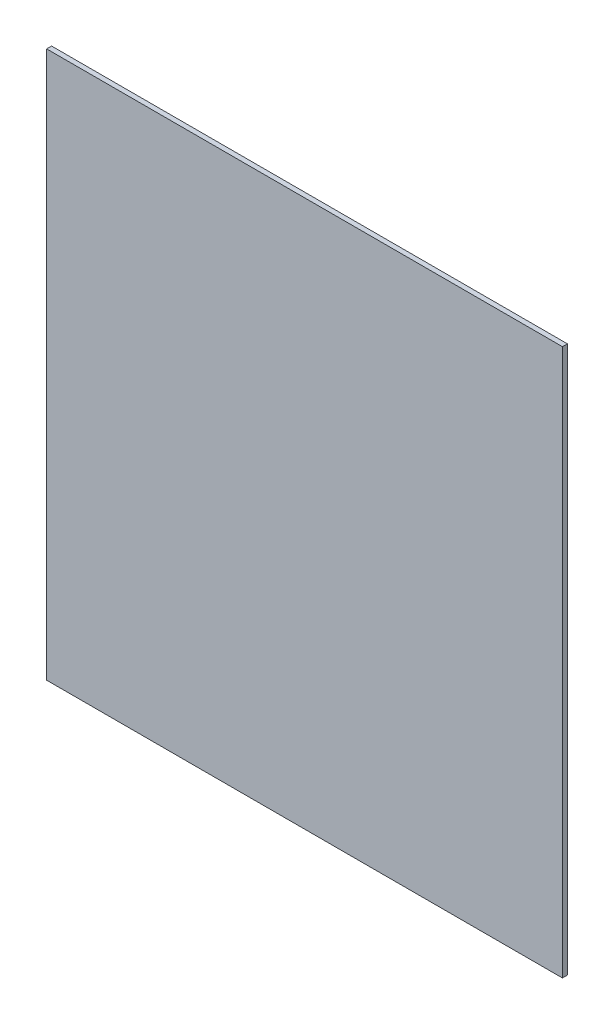
ISO-10303-21;
HEADER;
FILE_DESCRIPTION(('STEP AP214'),'2;1');
FILE_NAME('part.step','',(''),(''),'','','');
FILE_SCHEMA(('AUTOMOTIVE_DESIGN { 1 0 10303 214 1 1 1 1 }'));
ENDSEC;
DATA;
#1=APPLICATION_CONTEXT('core data for automotive mechanical design processes');
#2=APPLICATION_PROTOCOL_DEFINITION('international standard','automotive_design',2000,#1);
#3=PRODUCT_CONTEXT('',#1,'mechanical');
#4=PRODUCT('Part','Part','',(#3));
#5=PRODUCT_RELATED_PRODUCT_CATEGORY('part','',(#4));
#6=PRODUCT_DEFINITION_FORMATION('','',#4);
#7=PRODUCT_DEFINITION_CONTEXT('part definition',#1,'design');
#8=PRODUCT_DEFINITION('design','',#6,#7);
#9=PRODUCT_DEFINITION_SHAPE('','',#8);
#10=(LENGTH_UNIT() NAMED_UNIT(*) SI_UNIT(.MILLI.,.METRE.));
#11=(NAMED_UNIT(*) PLANE_ANGLE_UNIT() SI_UNIT($,.RADIAN.));
#12=(NAMED_UNIT(*) SI_UNIT($,.STERADIAN.) SOLID_ANGLE_UNIT());
#13=UNCERTAINTY_MEASURE_WITH_UNIT(LENGTH_MEASURE(1.E-05),#10,'distance_accuracy_value','');
#14=(GEOMETRIC_REPRESENTATION_CONTEXT(3) GLOBAL_UNCERTAINTY_ASSIGNED_CONTEXT((#13)) GLOBAL_UNIT_ASSIGNED_CONTEXT((#10,
#11,#12)) REPRESENTATION_CONTEXT('',''));
#15=CARTESIAN_POINT('',(0.,0.,0.));
#16=DIRECTION('',(0.,0.,1.));
#17=DIRECTION('',(1.,0.,0.));
#18=AXIS2_PLACEMENT_3D('',#15,#16,#17);
#19=CARTESIAN_POINT('',(-67.04,-91.3291046998612,0.126999999999988));
#20=DIRECTION('',(-1.,0.,0.));
#21=DIRECTION('',(0.,0.,1.));
#22=AXIS2_PLACEMENT_3D('',#19,#20,#21);
#23=PLANE('',#22);
#24=DIRECTION('',(0.,1.,0.));
#25=VECTOR('',#24,1.);
#26=CARTESIAN_POINT('',(-67.04,-91.3291046998612,0.));
#27=LINE('',#26,#25);
#28=CARTESIAN_POINT('',(-67.04,-91.3291046998612,0.));
#29=VERTEX_POINT('',#28);
#30=CARTESIAN_POINT('',(-67.04,-77.2953546998612,0.));
#31=VERTEX_POINT('',#30);
#32=EDGE_CURVE('E95',#29,#31,#27,.T.);
#33=ORIENTED_EDGE('',*,*,#32,.T.);
#34=DIRECTION('',(0.,0.,-1.));
#35=VECTOR('',#34,1.);
#36=CARTESIAN_POINT('',(-67.04,-77.2953546998612,0.126999999999988));
#37=LINE('',#36,#35);
#38=CARTESIAN_POINT('',(-67.04,-77.2953546998612,0.126999999999988));
#39=VERTEX_POINT('',#38);
#40=EDGE_CURVE('E11',#39,#31,#37,.T.);
#41=ORIENTED_EDGE('',*,*,#40,.F.);
#42=DIRECTION('',(0.,1.,0.));
#43=VECTOR('',#42,1.);
#44=CARTESIAN_POINT('',(-67.04,-91.3291046998612,0.126999999999988));
#45=LINE('',#44,#43);
#46=CARTESIAN_POINT('',(-67.04,-91.3291046998612,0.126999999999988));
#47=VERTEX_POINT('',#46);
#48=EDGE_CURVE('E83',#47,#39,#45,.T.);
#49=ORIENTED_EDGE('',*,*,#48,.F.);
#50=DIRECTION('',(0.,0.,-1.));
#51=VECTOR('',#50,1.);
#52=CARTESIAN_POINT('',(-67.04,-91.3291046998612,0.126999999999988));
#53=LINE('',#52,#51);
#54=EDGE_CURVE('E91',#47,#29,#53,.T.);
#55=ORIENTED_EDGE('',*,*,#54,.T.);
#56=EDGE_LOOP('',(#33,#41,#49,#55));
#57=FACE_BOUND('',#56,.T.);
#58=ADVANCED_FACE('F32',(#57),#23,.F.);
#59=CARTESIAN_POINT('',(-67.04,-77.2953546998612,0.126999999999988));
#60=DIRECTION('',(0.,-1.,0.));
#61=DIRECTION('',(0.,0.,-1.));
#62=AXIS2_PLACEMENT_3D('',#59,#60,#61);
#63=PLANE('',#62);
#64=DIRECTION('',(-1.,0.,0.));
#65=VECTOR('',#64,1.);
#66=CARTESIAN_POINT('',(-67.04,-77.2953546998612,0.));
#67=LINE('',#66,#65);
#68=CARTESIAN_POINT('',(-80.28,-77.2953546998612,0.));
#69=VERTEX_POINT('',#68);
#70=EDGE_CURVE('E87',#31,#69,#67,.T.);
#71=ORIENTED_EDGE('',*,*,#70,.T.);
#72=DIRECTION('',(0.,0.,-1.));
#73=VECTOR('',#72,1.);
#74=CARTESIAN_POINT('',(-80.28,-77.2953546998612,0.126999999999988));
#75=LINE('',#74,#73);
#76=CARTESIAN_POINT('',(-80.28,-77.2953546998612,0.126999999999988));
#77=VERTEX_POINT('',#76);
#78=EDGE_CURVE('E40',#77,#69,#75,.T.);
#79=ORIENTED_EDGE('',*,*,#78,.F.);
#80=DIRECTION('',(-1.,0.,0.));
#81=VECTOR('',#80,1.);
#82=CARTESIAN_POINT('',(-67.04,-77.2953546998612,0.126999999999988));
#83=LINE('',#82,#81);
#84=EDGE_CURVE('E78',#39,#77,#83,.T.);
#85=ORIENTED_EDGE('',*,*,#84,.F.);
#86=ORIENTED_EDGE('',*,*,#40,.T.);
#87=EDGE_LOOP('',(#71,#79,#85,#86));
#88=FACE_BOUND('',#87,.T.);
#89=ADVANCED_FACE('F86',(#88),#63,.F.);
#90=CARTESIAN_POINT('',(-80.28,-91.3291046998612,0.126999999999988));
#91=DIRECTION('',(1.,0.,0.));
#92=DIRECTION('',(0.,0.,-1.));
#93=AXIS2_PLACEMENT_3D('',#90,#91,#92);
#94=PLANE('',#93);
#95=DIRECTION('',(0.,-1.,0.));
#96=VECTOR('',#95,1.);
#97=CARTESIAN_POINT('',(-80.28,-91.3291046998612,0.));
#98=LINE('',#97,#96);
#99=CARTESIAN_POINT('',(-80.28,-91.3291046998612,0.));
#100=VERTEX_POINT('',#99);
#101=EDGE_CURVE('E65',#69,#100,#98,.T.);
#102=ORIENTED_EDGE('',*,*,#101,.T.);
#103=DIRECTION('',(0.,0.,-1.));
#104=VECTOR('',#103,1.);
#105=CARTESIAN_POINT('',(-80.28,-91.3291046998612,0.126999999999988));
#106=LINE('',#105,#104);
#107=CARTESIAN_POINT('',(-80.28,-91.3291046998612,0.126999999999988));
#108=VERTEX_POINT('',#107);
#109=EDGE_CURVE('E88',#108,#100,#106,.T.);
#110=ORIENTED_EDGE('',*,*,#109,.F.);
#111=DIRECTION('',(0.,-1.,0.));
#112=VECTOR('',#111,1.);
#113=CARTESIAN_POINT('',(-80.28,-91.3291046998612,0.126999999999988));
#114=LINE('',#113,#112);
#115=EDGE_CURVE('E81',#77,#108,#114,.T.);
#116=ORIENTED_EDGE('',*,*,#115,.F.);
#117=ORIENTED_EDGE('',*,*,#78,.T.);
#118=EDGE_LOOP('',(#102,#110,#116,#117));
#119=FACE_BOUND('',#118,.T.);
#120=ADVANCED_FACE('F89',(#119),#94,.F.);
#121=CARTESIAN_POINT('',(-67.04,-91.3291046998612,0.126999999999988));
#122=DIRECTION('',(0.,1.,0.));
#123=DIRECTION('',(0.,0.,1.));
#124=AXIS2_PLACEMENT_3D('',#121,#122,#123);
#125=PLANE('',#124);
#126=DIRECTION('',(1.,0.,0.));
#127=VECTOR('',#126,1.);
#128=CARTESIAN_POINT('',(-67.04,-91.3291046998612,0.));
#129=LINE('',#128,#127);
#130=EDGE_CURVE('E71',#100,#29,#129,.T.);
#131=ORIENTED_EDGE('',*,*,#130,.T.);
#132=ORIENTED_EDGE('',*,*,#54,.F.);
#133=DIRECTION('',(1.,0.,0.));
#134=VECTOR('',#133,1.);
#135=CARTESIAN_POINT('',(-67.04,-91.3291046998612,0.126999999999988));
#136=LINE('',#135,#134);
#137=EDGE_CURVE('E48',#108,#47,#136,.T.);
#138=ORIENTED_EDGE('',*,*,#137,.F.);
#139=ORIENTED_EDGE('',*,*,#109,.T.);
#140=EDGE_LOOP('',(#131,#132,#138,#139));
#141=FACE_BOUND('',#140,.T.);
#142=ADVANCED_FACE('F102',(#141),#125,.F.);
#143=CARTESIAN_POINT('',(0.,0.,0.126999999999988));
#144=DIRECTION('',(0.,0.,1.));
#145=DIRECTION('',(1.,0.,0.));
#146=AXIS2_PLACEMENT_3D('',#143,#144,#145);
#147=PLANE('',#146);
#148=ORIENTED_EDGE('',*,*,#48,.T.);
#149=ORIENTED_EDGE('',*,*,#84,.T.);
#150=ORIENTED_EDGE('',*,*,#115,.T.);
#151=ORIENTED_EDGE('',*,*,#137,.T.);
#152=EDGE_LOOP('',(#148,#149,#150,#151));
#153=FACE_BOUND('',#152,.T.);
#154=ADVANCED_FACE('F79',(#153),#147,.T.);
#155=CARTESIAN_POINT('',(0.,0.,0.));
#156=DIRECTION('',(0.,0.,1.));
#157=DIRECTION('',(1.,0.,0.));
#158=AXIS2_PLACEMENT_3D('',#155,#156,#157);
#159=PLANE('',#158);
#160=ORIENTED_EDGE('',*,*,#32,.F.);
#161=ORIENTED_EDGE('',*,*,#130,.F.);
#162=ORIENTED_EDGE('',*,*,#101,.F.);
#163=ORIENTED_EDGE('',*,*,#70,.F.);
#164=EDGE_LOOP('',(#160,#161,#162,#163));
#165=FACE_BOUND('',#164,.T.);
#166=ADVANCED_FACE('F105',(#165),#159,.F.);
#167=CLOSED_SHELL('',(#58,#89,#120,#142,#154,#166));
#168=MANIFOLD_SOLID_BREP('B2',#167);
#169=ADVANCED_BREP_SHAPE_REPRESENTATION('',(#18,#168),#14);
#170=SHAPE_DEFINITION_REPRESENTATION(#9,#169);
ENDSEC;
END-ISO-10303-21;
